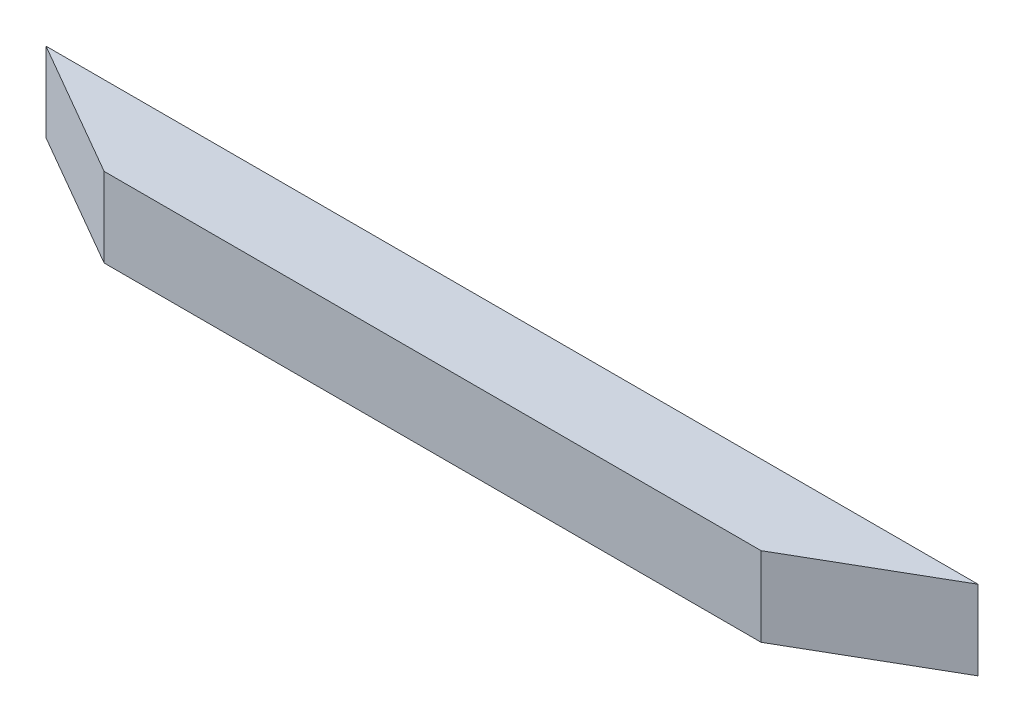
ISO-10303-21;
HEADER;
FILE_DESCRIPTION(('STEP AP214'),'2;1');
FILE_NAME('part.step','',(''),(''),'','','');
FILE_SCHEMA(('AUTOMOTIVE_DESIGN { 1 0 10303 214 1 1 1 1 }'));
ENDSEC;
DATA;
#1=APPLICATION_CONTEXT('core data for automotive mechanical design processes');
#2=APPLICATION_PROTOCOL_DEFINITION('international standard','automotive_design',2000,#1);
#3=PRODUCT_CONTEXT('',#1,'mechanical');
#4=PRODUCT('Part','Part','',(#3));
#5=PRODUCT_RELATED_PRODUCT_CATEGORY('part','',(#4));
#6=PRODUCT_DEFINITION_FORMATION('','',#4);
#7=PRODUCT_DEFINITION_CONTEXT('part definition',#1,'design');
#8=PRODUCT_DEFINITION('design','',#6,#7);
#9=PRODUCT_DEFINITION_SHAPE('','',#8);
#10=(LENGTH_UNIT() NAMED_UNIT(*) SI_UNIT(.MILLI.,.METRE.));
#11=(NAMED_UNIT(*) PLANE_ANGLE_UNIT() SI_UNIT($,.RADIAN.));
#12=(NAMED_UNIT(*) SI_UNIT($,.STERADIAN.) SOLID_ANGLE_UNIT());
#13=UNCERTAINTY_MEASURE_WITH_UNIT(LENGTH_MEASURE(1.E-05),#10,'distance_accuracy_value','');
#14=(GEOMETRIC_REPRESENTATION_CONTEXT(3) GLOBAL_UNCERTAINTY_ASSIGNED_CONTEXT((#13)) GLOBAL_UNIT_ASSIGNED_CONTEXT((#10,
#11,#12)) REPRESENTATION_CONTEXT('',''));
#15=CARTESIAN_POINT('',(0.,0.,0.));
#16=DIRECTION('',(0.,0.,1.));
#17=DIRECTION('',(1.,0.,0.));
#18=AXIS2_PLACEMENT_3D('',#15,#16,#17);
#19=CARTESIAN_POINT('',(-82.759491924311,20.,10.));
#20=DIRECTION('',(0.499999999999995,0.,-0.866025403784442));
#21=DIRECTION('',(-0.866025403784442,0.,-0.499999999999995));
#22=AXIS2_PLACEMENT_3D('',#19,#20,#21);
#23=PLANE('',#22);
#24=DIRECTION('',(0.866025403784442,0.,0.499999999999995));
#25=VECTOR('',#24,1.);
#26=CARTESIAN_POINT('',(-82.759491924311,0.,10.));
#27=LINE('',#26,#25);
#28=CARTESIAN_POINT('',(-117.400508075689,0.,-9.99999999999997));
#29=VERTEX_POINT('',#28);
#30=CARTESIAN_POINT('',(-82.759491924311,0.,10.));
#31=VERTEX_POINT('',#30);
#32=EDGE_CURVE('E95',#29,#31,#27,.T.);
#33=ORIENTED_EDGE('',*,*,#32,.T.);
#34=DIRECTION('',(0.,-1.,0.));
#35=VECTOR('',#34,1.);
#36=CARTESIAN_POINT('',(-82.759491924311,20.,10.));
#37=LINE('',#36,#35);
#38=CARTESIAN_POINT('',(-82.759491924311,20.,10.));
#39=VERTEX_POINT('',#38);
#40=EDGE_CURVE('E11',#39,#31,#37,.T.);
#41=ORIENTED_EDGE('',*,*,#40,.F.);
#42=DIRECTION('',(0.866025403784442,0.,0.499999999999995));
#43=VECTOR('',#42,1.);
#44=CARTESIAN_POINT('',(-82.759491924311,20.,10.));
#45=LINE('',#44,#43);
#46=CARTESIAN_POINT('',(-117.400508075689,20.,-9.99999999999997));
#47=VERTEX_POINT('',#46);
#48=EDGE_CURVE('E83',#47,#39,#45,.T.);
#49=ORIENTED_EDGE('',*,*,#48,.F.);
#50=DIRECTION('',(0.,-1.,0.));
#51=VECTOR('',#50,1.);
#52=CARTESIAN_POINT('',(-117.400508075689,20.,-9.99999999999997));
#53=LINE('',#52,#51);
#54=EDGE_CURVE('E91',#47,#29,#53,.T.);
#55=ORIENTED_EDGE('',*,*,#54,.T.);
#56=EDGE_LOOP('',(#33,#41,#49,#55));
#57=FACE_BOUND('',#56,.T.);
#58=ADVANCED_FACE('F32',(#57),#23,.F.);
#59=CARTESIAN_POINT('',(-82.759491924311,20.,10.));
#60=DIRECTION('',(0.,0.,-1.));
#61=DIRECTION('',(-1.,0.,0.));
#62=AXIS2_PLACEMENT_3D('',#59,#60,#61);
#63=PLANE('',#62);
#64=DIRECTION('',(1.,0.,0.));
#65=VECTOR('',#64,1.);
#66=CARTESIAN_POINT('',(-82.759491924311,0.,10.));
#67=LINE('',#66,#65);
#68=CARTESIAN_POINT('',(82.759491924311,0.,9.99999999999998));
#69=VERTEX_POINT('',#68);
#70=EDGE_CURVE('E87',#31,#69,#67,.T.);
#71=ORIENTED_EDGE('',*,*,#70,.T.);
#72=DIRECTION('',(0.,-1.,0.));
#73=VECTOR('',#72,1.);
#74=CARTESIAN_POINT('',(82.759491924311,20.,9.99999999999998));
#75=LINE('',#74,#73);
#76=CARTESIAN_POINT('',(82.759491924311,20.,9.99999999999998));
#77=VERTEX_POINT('',#76);
#78=EDGE_CURVE('E40',#77,#69,#75,.T.);
#79=ORIENTED_EDGE('',*,*,#78,.F.);
#80=DIRECTION('',(1.,0.,0.));
#81=VECTOR('',#80,1.);
#82=CARTESIAN_POINT('',(-82.759491924311,20.,10.));
#83=LINE('',#82,#81);
#84=EDGE_CURVE('E78',#39,#77,#83,.T.);
#85=ORIENTED_EDGE('',*,*,#84,.F.);
#86=ORIENTED_EDGE('',*,*,#40,.T.);
#87=EDGE_LOOP('',(#71,#79,#85,#86));
#88=FACE_BOUND('',#87,.T.);
#89=ADVANCED_FACE('F86',(#88),#63,.F.);
#90=CARTESIAN_POINT('',(82.759491924311,20.,9.99999999999998));
#91=DIRECTION('',(-0.499999999999995,0.,-0.866025403784442));
#92=DIRECTION('',(-0.866025403784442,0.,0.499999999999995));
#93=AXIS2_PLACEMENT_3D('',#90,#91,#92);
#94=PLANE('',#93);
#95=DIRECTION('',(0.866025403784442,0.,-0.499999999999995));
#96=VECTOR('',#95,1.);
#97=CARTESIAN_POINT('',(82.759491924311,0.,9.99999999999998));
#98=LINE('',#97,#96);
#99=CARTESIAN_POINT('',(117.400508075689,0.,-10.));
#100=VERTEX_POINT('',#99);
#101=EDGE_CURVE('E65',#69,#100,#98,.T.);
#102=ORIENTED_EDGE('',*,*,#101,.T.);
#103=DIRECTION('',(0.,-1.,0.));
#104=VECTOR('',#103,1.);
#105=CARTESIAN_POINT('',(117.400508075689,20.,-10.));
#106=LINE('',#105,#104);
#107=CARTESIAN_POINT('',(117.400508075689,20.,-10.));
#108=VERTEX_POINT('',#107);
#109=EDGE_CURVE('E88',#108,#100,#106,.T.);
#110=ORIENTED_EDGE('',*,*,#109,.F.);
#111=DIRECTION('',(0.866025403784442,0.,-0.499999999999995));
#112=VECTOR('',#111,1.);
#113=CARTESIAN_POINT('',(82.759491924311,20.,9.99999999999998));
#114=LINE('',#113,#112);
#115=EDGE_CURVE('E81',#77,#108,#114,.T.);
#116=ORIENTED_EDGE('',*,*,#115,.F.);
#117=ORIENTED_EDGE('',*,*,#78,.T.);
#118=EDGE_LOOP('',(#102,#110,#116,#117));
#119=FACE_BOUND('',#118,.T.);
#120=ADVANCED_FACE('F89',(#119),#94,.F.);
#121=CARTESIAN_POINT('',(117.400508075689,20.,-10.));
#122=DIRECTION('',(0.,0.,1.));
#123=DIRECTION('',(1.,0.,0.));
#124=AXIS2_PLACEMENT_3D('',#121,#122,#123);
#125=PLANE('',#124);
#126=DIRECTION('',(-1.,0.,0.));
#127=VECTOR('',#126,1.);
#128=CARTESIAN_POINT('',(117.400508075689,0.,-10.));
#129=LINE('',#128,#127);
#130=EDGE_CURVE('E71',#100,#29,#129,.T.);
#131=ORIENTED_EDGE('',*,*,#130,.T.);
#132=ORIENTED_EDGE('',*,*,#54,.F.);
#133=DIRECTION('',(-1.,0.,0.));
#134=VECTOR('',#133,1.);
#135=CARTESIAN_POINT('',(117.400508075689,20.,-10.));
#136=LINE('',#135,#134);
#137=EDGE_CURVE('E48',#108,#47,#136,.T.);
#138=ORIENTED_EDGE('',*,*,#137,.F.);
#139=ORIENTED_EDGE('',*,*,#109,.T.);
#140=EDGE_LOOP('',(#131,#132,#138,#139));
#141=FACE_BOUND('',#140,.T.);
#142=ADVANCED_FACE('F102',(#141),#125,.F.);
#143=CARTESIAN_POINT('',(0.,20.,0.));
#144=DIRECTION('',(0.,-1.,0.));
#145=DIRECTION('',(0.,0.,-1.));
#146=AXIS2_PLACEMENT_3D('',#143,#144,#145);
#147=PLANE('',#146);
#148=ORIENTED_EDGE('',*,*,#48,.T.);
#149=ORIENTED_EDGE('',*,*,#84,.T.);
#150=ORIENTED_EDGE('',*,*,#115,.T.);
#151=ORIENTED_EDGE('',*,*,#137,.T.);
#152=EDGE_LOOP('',(#148,#149,#150,#151));
#153=FACE_BOUND('',#152,.T.);
#154=ADVANCED_FACE('F79',(#153),#147,.F.);
#155=CARTESIAN_POINT('',(0.,0.,0.));
#156=DIRECTION('',(0.,-1.,0.));
#157=DIRECTION('',(0.,0.,-1.));
#158=AXIS2_PLACEMENT_3D('',#155,#156,#157);
#159=PLANE('',#158);
#160=ORIENTED_EDGE('',*,*,#32,.F.);
#161=ORIENTED_EDGE('',*,*,#130,.F.);
#162=ORIENTED_EDGE('',*,*,#101,.F.);
#163=ORIENTED_EDGE('',*,*,#70,.F.);
#164=EDGE_LOOP('',(#160,#161,#162,#163));
#165=FACE_BOUND('',#164,.T.);
#166=ADVANCED_FACE('F105',(#165),#159,.T.);
#167=CLOSED_SHELL('',(#58,#89,#120,#142,#154,#166));
#168=MANIFOLD_SOLID_BREP('B2',#167);
#169=ADVANCED_BREP_SHAPE_REPRESENTATION('',(#18,#168),#14);
#170=SHAPE_DEFINITION_REPRESENTATION(#9,#169);
ENDSEC;
END-ISO-10303-21;
